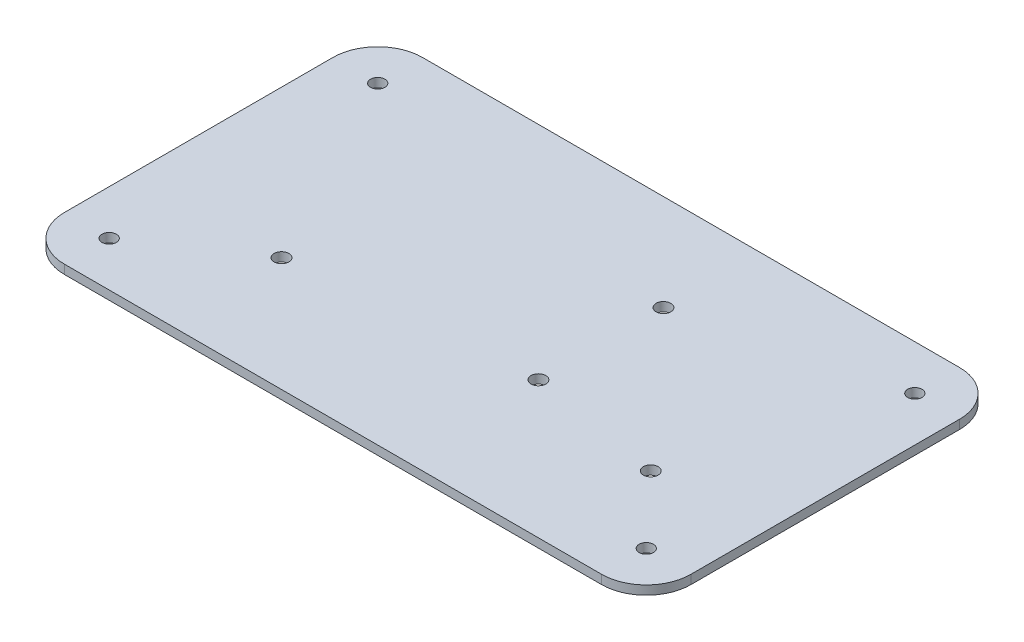
ISO-10303-21;
HEADER;
FILE_DESCRIPTION(('STEP AP214'),'2;1');
FILE_NAME('part.step','',(''),(''),'','','');
FILE_SCHEMA(('AUTOMOTIVE_DESIGN { 1 0 10303 214 1 1 1 1 }'));
ENDSEC;
DATA;
#1=APPLICATION_CONTEXT('core data for automotive mechanical design processes');
#2=APPLICATION_PROTOCOL_DEFINITION('international standard','automotive_design',2000,#1);
#3=PRODUCT_CONTEXT('',#1,'mechanical');
#4=PRODUCT('Part','Part','',(#3));
#5=PRODUCT_RELATED_PRODUCT_CATEGORY('part','',(#4));
#6=PRODUCT_DEFINITION_FORMATION('','',#4);
#7=PRODUCT_DEFINITION_CONTEXT('part definition',#1,'design');
#8=PRODUCT_DEFINITION('design','',#6,#7);
#9=PRODUCT_DEFINITION_SHAPE('','',#8);
#10=(LENGTH_UNIT() NAMED_UNIT(*) SI_UNIT(.MILLI.,.METRE.));
#11=(NAMED_UNIT(*) PLANE_ANGLE_UNIT() SI_UNIT($,.RADIAN.));
#12=(NAMED_UNIT(*) SI_UNIT($,.STERADIAN.) SOLID_ANGLE_UNIT());
#13=UNCERTAINTY_MEASURE_WITH_UNIT(LENGTH_MEASURE(1.E-05),#10,'distance_accuracy_value','');
#14=(GEOMETRIC_REPRESENTATION_CONTEXT(3) GLOBAL_UNCERTAINTY_ASSIGNED_CONTEXT((#13)) GLOBAL_UNIT_ASSIGNED_CONTEXT((#10,
#11,#12)) REPRESENTATION_CONTEXT('',''));
#15=CARTESIAN_POINT('',(0.,0.,0.));
#16=DIRECTION('',(0.,0.,1.));
#17=DIRECTION('',(1.,0.,0.));
#18=AXIS2_PLACEMENT_3D('',#15,#16,#17);
#19=CARTESIAN_POINT('',(0.,0.,0.));
#20=DIRECTION('',(0.,-1.,0.));
#21=DIRECTION('',(0.,0.,-1.));
#22=AXIS2_PLACEMENT_3D('',#19,#20,#21);
#23=PLANE('',#22);
#24=DIRECTION('',(0.,0.,1.));
#25=VECTOR('',#24,1.);
#26=CARTESIAN_POINT('',(-70.,0.,-30.));
#27=LINE('',#26,#25);
#28=CARTESIAN_POINT('',(-70.,0.,-20.));
#29=VERTEX_POINT('',#28);
#30=CARTESIAN_POINT('',(-70.,0.,40.));
#31=VERTEX_POINT('',#30);
#32=EDGE_CURVE('E116',#29,#31,#27,.T.);
#33=ORIENTED_EDGE('',*,*,#32,.F.);
#34=CARTESIAN_POINT('',(-60.,0.,-20.));
#35=DIRECTION('',(0.,1.,0.));
#36=DIRECTION('',(0.,0.,1.));
#37=AXIS2_PLACEMENT_3D('',#34,#35,#36);
#38=CIRCLE('',#37,10.);
#39=CARTESIAN_POINT('',(-60.,0.,-30.));
#40=VERTEX_POINT('',#39);
#41=EDGE_CURVE('E96',#40,#29,#38,.T.);
#42=ORIENTED_EDGE('',*,*,#41,.F.);
#43=DIRECTION('',(-1.,0.,0.));
#44=VECTOR('',#43,1.);
#45=CARTESIAN_POINT('',(-70.,0.,-30.));
#46=LINE('',#45,#44);
#47=CARTESIAN_POINT('',(60.,0.,-30.));
#48=VERTEX_POINT('',#47);
#49=EDGE_CURVE('E93',#48,#40,#46,.T.);
#50=ORIENTED_EDGE('',*,*,#49,.F.);
#51=CARTESIAN_POINT('',(60.,0.,-20.));
#52=DIRECTION('',(0.,1.,0.));
#53=DIRECTION('',(0.,0.,1.));
#54=AXIS2_PLACEMENT_3D('',#51,#52,#53);
#55=CIRCLE('',#54,10.);
#56=CARTESIAN_POINT('',(70.,0.,-20.));
#57=VERTEX_POINT('',#56);
#58=EDGE_CURVE('E80',#57,#48,#55,.T.);
#59=ORIENTED_EDGE('',*,*,#58,.F.);
#60=DIRECTION('',(0.,0.,-1.));
#61=VECTOR('',#60,1.);
#62=CARTESIAN_POINT('',(70.,0.,-30.));
#63=LINE('',#62,#61);
#64=CARTESIAN_POINT('',(70.,0.,40.));
#65=VERTEX_POINT('',#64);
#66=EDGE_CURVE('E90',#65,#57,#63,.T.);
#67=ORIENTED_EDGE('',*,*,#66,.F.);
#68=CARTESIAN_POINT('',(60.,0.,40.));
#69=DIRECTION('',(0.,1.,0.));
#70=DIRECTION('',(0.,0.,1.));
#71=AXIS2_PLACEMENT_3D('',#68,#69,#70);
#72=CIRCLE('',#71,10.);
#73=CARTESIAN_POINT('',(60.,0.,50.));
#74=VERTEX_POINT('',#73);
#75=EDGE_CURVE('E112',#74,#65,#72,.T.);
#76=ORIENTED_EDGE('',*,*,#75,.F.);
#77=DIRECTION('',(1.,0.,0.));
#78=VECTOR('',#77,1.);
#79=CARTESIAN_POINT('',(-70.,0.,50.));
#80=LINE('',#79,#78);
#81=CARTESIAN_POINT('',(-60.,0.,50.));
#82=VERTEX_POINT('',#81);
#83=EDGE_CURVE('E110',#82,#74,#80,.T.);
#84=ORIENTED_EDGE('',*,*,#83,.F.);
#85=CARTESIAN_POINT('',(-60.,0.,40.));
#86=DIRECTION('',(0.,1.,0.));
#87=DIRECTION('',(0.,0.,1.));
#88=AXIS2_PLACEMENT_3D('',#85,#86,#87);
#89=CIRCLE('',#88,10.);
#90=EDGE_CURVE('E163',#31,#82,#89,.T.);
#91=ORIENTED_EDGE('',*,*,#90,.F.);
#92=EDGE_LOOP('',(#33,#42,#50,#59,#67,#76,#84,#91));
#93=FACE_BOUND('',#92,.T.);
#94=CARTESIAN_POINT('',(-37.,0.,24.5));
#95=DIRECTION('',(0.,1.,0.));
#96=DIRECTION('',(0.,0.,1.));
#97=AXIS2_PLACEMENT_3D('',#94,#95,#96);
#98=CIRCLE('',#97,1.651);
#99=CARTESIAN_POINT('',(-37.,0.,26.151));
#100=VERTEX_POINT('',#99);
#101=EDGE_CURVE('E154',#100,#100,#98,.T.);
#102=ORIENTED_EDGE('',*,*,#101,.T.);
#103=EDGE_LOOP('',(#102));
#104=FACE_BOUND('',#103,.T.);
#105=CARTESIAN_POINT('',(45.5,0.,24.5));
#106=DIRECTION('',(0.,1.,0.));
#107=DIRECTION('',(0.,0.,1.));
#108=AXIS2_PLACEMENT_3D('',#105,#106,#107);
#109=CIRCLE('',#108,1.651);
#110=CARTESIAN_POINT('',(45.5,0.,26.151));
#111=VERTEX_POINT('',#110);
#112=EDGE_CURVE('E169',#111,#111,#109,.T.);
#113=ORIENTED_EDGE('',*,*,#112,.T.);
#114=EDGE_LOOP('',(#113));
#115=FACE_BOUND('',#114,.T.);
#116=CARTESIAN_POINT('',(15.324,0.,19.42));
#117=DIRECTION('',(0.,1.,0.));
#118=DIRECTION('',(0.,0.,1.));
#119=AXIS2_PLACEMENT_3D('',#116,#117,#118);
#120=CIRCLE('',#119,1.65);
#121=CARTESIAN_POINT('',(15.324,0.,21.07));
#122=VERTEX_POINT('',#121);
#123=EDGE_CURVE('E157',#122,#122,#120,.T.);
#124=ORIENTED_EDGE('',*,*,#123,.T.);
#125=EDGE_LOOP('',(#124));
#126=FACE_BOUND('',#125,.T.);
#127=CARTESIAN_POINT('',(15.324,0.,-8.52));
#128=DIRECTION('',(0.,1.,0.));
#129=DIRECTION('',(0.,0.,1.));
#130=AXIS2_PLACEMENT_3D('',#127,#128,#129);
#131=CIRCLE('',#130,1.651);
#132=CARTESIAN_POINT('',(15.324,0.,-6.869));
#133=VERTEX_POINT('',#132);
#134=EDGE_CURVE('E115',#133,#133,#131,.T.);
#135=ORIENTED_EDGE('',*,*,#134,.T.);
#136=EDGE_LOOP('',(#135));
#137=FACE_BOUND('',#136,.T.);
#138=CARTESIAN_POINT('',(-60.,0.,-20.));
#139=DIRECTION('',(0.,1.,0.));
#140=DIRECTION('',(0.,0.,1.));
#141=AXIS2_PLACEMENT_3D('',#138,#139,#140);
#142=CIRCLE('',#141,1.6);
#143=CARTESIAN_POINT('',(-60.,0.,-18.4));
#144=VERTEX_POINT('',#143);
#145=EDGE_CURVE('E172',#144,#144,#142,.T.);
#146=ORIENTED_EDGE('',*,*,#145,.T.);
#147=EDGE_LOOP('',(#146));
#148=FACE_BOUND('',#147,.T.);
#149=CARTESIAN_POINT('',(-60.,0.,40.));
#150=DIRECTION('',(0.,1.,0.));
#151=DIRECTION('',(0.,0.,1.));
#152=AXIS2_PLACEMENT_3D('',#149,#150,#151);
#153=CIRCLE('',#152,1.6);
#154=CARTESIAN_POINT('',(-60.,0.,41.6));
#155=VERTEX_POINT('',#154);
#156=EDGE_CURVE('E175',#155,#155,#153,.T.);
#157=ORIENTED_EDGE('',*,*,#156,.T.);
#158=EDGE_LOOP('',(#157));
#159=FACE_BOUND('',#158,.T.);
#160=CARTESIAN_POINT('',(60.,0.,-20.));
#161=DIRECTION('',(0.,1.,0.));
#162=DIRECTION('',(0.,0.,1.));
#163=AXIS2_PLACEMENT_3D('',#160,#161,#162);
#164=CIRCLE('',#163,1.6);
#165=CARTESIAN_POINT('',(60.,0.,-18.4));
#166=VERTEX_POINT('',#165);
#167=EDGE_CURVE('E177',#166,#166,#164,.T.);
#168=ORIENTED_EDGE('',*,*,#167,.T.);
#169=EDGE_LOOP('',(#168));
#170=FACE_BOUND('',#169,.T.);
#171=CARTESIAN_POINT('',(60.,0.,40.));
#172=DIRECTION('',(0.,1.,0.));
#173=DIRECTION('',(0.,0.,1.));
#174=AXIS2_PLACEMENT_3D('',#171,#172,#173);
#175=CIRCLE('',#174,1.6);
#176=CARTESIAN_POINT('',(60.,0.,41.6));
#177=VERTEX_POINT('',#176);
#178=EDGE_CURVE('E20',#177,#177,#175,.T.);
#179=ORIENTED_EDGE('',*,*,#178,.T.);
#180=EDGE_LOOP('',(#179));
#181=FACE_BOUND('',#180,.T.);
#182=ADVANCED_FACE('F17',(#93,#104,#115,#126,#137,#148,#159,#170,#181),#23,.T.);
#183=CARTESIAN_POINT('',(60.,0.,40.));
#184=DIRECTION('',(0.,1.,0.));
#185=DIRECTION('',(0.,0.,1.));
#186=AXIS2_PLACEMENT_3D('',#183,#184,#185);
#187=CYLINDRICAL_SURFACE('',#186,1.6);
#188=CARTESIAN_POINT('',(60.,2.,40.));
#189=DIRECTION('',(0.,1.,0.));
#190=DIRECTION('',(0.,0.,1.));
#191=AXIS2_PLACEMENT_3D('',#188,#189,#190);
#192=CIRCLE('',#191,1.6);
#193=CARTESIAN_POINT('',(60.,2.,41.6));
#194=VERTEX_POINT('',#193);
#195=EDGE_CURVE('E151',#194,#194,#192,.F.);
#196=ORIENTED_EDGE('',*,*,#195,.F.);
#197=EDGE_LOOP('',(#196));
#198=FACE_BOUND('',#197,.T.);
#199=ORIENTED_EDGE('',*,*,#178,.F.);
#200=EDGE_LOOP('',(#199));
#201=FACE_BOUND('',#200,.T.);
#202=ADVANCED_FACE('F185',(#198,#201),#187,.F.);
#203=CARTESIAN_POINT('',(60.,0.,-20.));
#204=DIRECTION('',(0.,1.,0.));
#205=DIRECTION('',(0.,0.,1.));
#206=AXIS2_PLACEMENT_3D('',#203,#204,#205);
#207=CYLINDRICAL_SURFACE('',#206,1.6);
#208=CARTESIAN_POINT('',(60.,2.,-20.));
#209=DIRECTION('',(0.,1.,0.));
#210=DIRECTION('',(0.,0.,1.));
#211=AXIS2_PLACEMENT_3D('',#208,#209,#210);
#212=CIRCLE('',#211,1.6);
#213=CARTESIAN_POINT('',(60.,2.,-18.4));
#214=VERTEX_POINT('',#213);
#215=EDGE_CURVE('E148',#214,#214,#212,.F.);
#216=ORIENTED_EDGE('',*,*,#215,.F.);
#217=EDGE_LOOP('',(#216));
#218=FACE_BOUND('',#217,.T.);
#219=ORIENTED_EDGE('',*,*,#167,.F.);
#220=EDGE_LOOP('',(#219));
#221=FACE_BOUND('',#220,.T.);
#222=ADVANCED_FACE('F187',(#218,#221),#207,.F.);
#223=CARTESIAN_POINT('',(-60.,0.,40.));
#224=DIRECTION('',(0.,1.,0.));
#225=DIRECTION('',(0.,0.,1.));
#226=AXIS2_PLACEMENT_3D('',#223,#224,#225);
#227=CYLINDRICAL_SURFACE('',#226,1.6);
#228=CARTESIAN_POINT('',(-60.,2.,40.));
#229=DIRECTION('',(0.,1.,0.));
#230=DIRECTION('',(0.,0.,1.));
#231=AXIS2_PLACEMENT_3D('',#228,#229,#230);
#232=CIRCLE('',#231,1.6);
#233=CARTESIAN_POINT('',(-60.,2.,41.6));
#234=VERTEX_POINT('',#233);
#235=EDGE_CURVE('E145',#234,#234,#232,.F.);
#236=ORIENTED_EDGE('',*,*,#235,.F.);
#237=EDGE_LOOP('',(#236));
#238=FACE_BOUND('',#237,.T.);
#239=ORIENTED_EDGE('',*,*,#156,.F.);
#240=EDGE_LOOP('',(#239));
#241=FACE_BOUND('',#240,.T.);
#242=ADVANCED_FACE('F194',(#238,#241),#227,.F.);
#243=CARTESIAN_POINT('',(-60.,0.,-20.));
#244=DIRECTION('',(0.,1.,0.));
#245=DIRECTION('',(0.,0.,1.));
#246=AXIS2_PLACEMENT_3D('',#243,#244,#245);
#247=CYLINDRICAL_SURFACE('',#246,1.6);
#248=CARTESIAN_POINT('',(-60.,2.,-20.));
#249=DIRECTION('',(0.,1.,0.));
#250=DIRECTION('',(0.,0.,1.));
#251=AXIS2_PLACEMENT_3D('',#248,#249,#250);
#252=CIRCLE('',#251,1.6);
#253=CARTESIAN_POINT('',(-60.,2.,-18.4));
#254=VERTEX_POINT('',#253);
#255=EDGE_CURVE('E142',#254,#254,#252,.F.);
#256=ORIENTED_EDGE('',*,*,#255,.F.);
#257=EDGE_LOOP('',(#256));
#258=FACE_BOUND('',#257,.T.);
#259=ORIENTED_EDGE('',*,*,#145,.F.);
#260=EDGE_LOOP('',(#259));
#261=FACE_BOUND('',#260,.T.);
#262=ADVANCED_FACE('F248',(#258,#261),#247,.F.);
#263=CARTESIAN_POINT('',(45.5,0.,24.5));
#264=DIRECTION('',(0.,1.,0.));
#265=DIRECTION('',(0.,0.,1.));
#266=AXIS2_PLACEMENT_3D('',#263,#264,#265);
#267=CYLINDRICAL_SURFACE('',#266,1.651);
#268=ORIENTED_EDGE('',*,*,#112,.F.);
#269=EDGE_LOOP('',(#268));
#270=FACE_BOUND('',#269,.T.);
#271=CARTESIAN_POINT('',(45.5,2.,24.5));
#272=DIRECTION('',(0.,1.,0.));
#273=DIRECTION('',(0.,0.,1.));
#274=AXIS2_PLACEMENT_3D('',#271,#272,#273);
#275=CIRCLE('',#274,1.651);
#276=CARTESIAN_POINT('',(45.5,2.,26.151));
#277=VERTEX_POINT('',#276);
#278=EDGE_CURVE('E139',#277,#277,#275,.F.);
#279=ORIENTED_EDGE('',*,*,#278,.F.);
#280=EDGE_LOOP('',(#279));
#281=FACE_BOUND('',#280,.T.);
#282=ADVANCED_FACE('F244',(#270,#281),#267,.F.);
#283=CARTESIAN_POINT('',(15.324,0.,-8.52));
#284=DIRECTION('',(0.,1.,0.));
#285=DIRECTION('',(0.,0.,1.));
#286=AXIS2_PLACEMENT_3D('',#283,#284,#285);
#287=CYLINDRICAL_SURFACE('',#286,1.651);
#288=ORIENTED_EDGE('',*,*,#134,.F.);
#289=EDGE_LOOP('',(#288));
#290=FACE_BOUND('',#289,.T.);
#291=CARTESIAN_POINT('',(15.324,2.,-8.52));
#292=DIRECTION('',(0.,1.,0.));
#293=DIRECTION('',(0.,0.,1.));
#294=AXIS2_PLACEMENT_3D('',#291,#292,#293);
#295=CIRCLE('',#294,1.651);
#296=CARTESIAN_POINT('',(15.324,2.,-6.869));
#297=VERTEX_POINT('',#296);
#298=EDGE_CURVE('E136',#297,#297,#295,.F.);
#299=ORIENTED_EDGE('',*,*,#298,.F.);
#300=EDGE_LOOP('',(#299));
#301=FACE_BOUND('',#300,.T.);
#302=ADVANCED_FACE('F240',(#290,#301),#287,.F.);
#303=CARTESIAN_POINT('',(70.,0.,-30.));
#304=DIRECTION('',(1.,0.,0.));
#305=DIRECTION('',(0.,0.,-1.));
#306=AXIS2_PLACEMENT_3D('',#303,#304,#305);
#307=PLANE('',#306);
#308=DIRECTION('',(0.,0.,1.));
#309=VECTOR('',#308,1.);
#310=CARTESIAN_POINT('',(70.,2.,0.));
#311=LINE('',#310,#309);
#312=CARTESIAN_POINT('',(70.,2.,40.));
#313=VERTEX_POINT('',#312);
#314=CARTESIAN_POINT('',(70.,2.,-20.));
#315=VERTEX_POINT('',#314);
#316=EDGE_CURVE('E135',#313,#315,#311,.F.);
#317=ORIENTED_EDGE('',*,*,#316,.F.);
#318=DIRECTION('',(0.,1.,0.));
#319=VECTOR('',#318,1.);
#320=CARTESIAN_POINT('',(70.,0.,40.));
#321=LINE('',#320,#319);
#322=EDGE_CURVE('E162',#65,#313,#321,.T.);
#323=ORIENTED_EDGE('',*,*,#322,.F.);
#324=ORIENTED_EDGE('',*,*,#66,.T.);
#325=DIRECTION('',(0.,1.,0.));
#326=VECTOR('',#325,1.);
#327=CARTESIAN_POINT('',(70.,0.,-20.));
#328=LINE('',#327,#326);
#329=EDGE_CURVE('E89',#315,#57,#328,.F.);
#330=ORIENTED_EDGE('',*,*,#329,.F.);
#331=EDGE_LOOP('',(#317,#323,#324,#330));
#332=FACE_BOUND('',#331,.T.);
#333=ADVANCED_FACE('F237',(#332),#307,.T.);
#334=CARTESIAN_POINT('',(60.,0.,-20.));
#335=DIRECTION('',(0.,1.,0.));
#336=DIRECTION('',(0.,0.,1.));
#337=AXIS2_PLACEMENT_3D('',#334,#335,#336);
#338=CYLINDRICAL_SURFACE('',#337,10.);
#339=CARTESIAN_POINT('',(60.,2.,-20.));
#340=DIRECTION('',(0.,1.,0.));
#341=DIRECTION('',(0.,0.,1.));
#342=AXIS2_PLACEMENT_3D('',#339,#340,#341);
#343=CIRCLE('',#342,10.);
#344=CARTESIAN_POINT('',(60.,2.,-30.));
#345=VERTEX_POINT('',#344);
#346=EDGE_CURVE('E133',#315,#345,#343,.T.);
#347=ORIENTED_EDGE('',*,*,#346,.F.);
#348=ORIENTED_EDGE('',*,*,#329,.T.);
#349=ORIENTED_EDGE('',*,*,#58,.T.);
#350=DIRECTION('',(0.,1.,0.));
#351=VECTOR('',#350,1.);
#352=CARTESIAN_POINT('',(60.,0.,-30.));
#353=LINE('',#352,#351);
#354=EDGE_CURVE('E87',#345,#48,#353,.F.);
#355=ORIENTED_EDGE('',*,*,#354,.F.);
#356=EDGE_LOOP('',(#347,#348,#349,#355));
#357=FACE_BOUND('',#356,.T.);
#358=ADVANCED_FACE('F85',(#357),#338,.T.);
#359=CARTESIAN_POINT('',(-70.,0.,-30.));
#360=DIRECTION('',(0.,0.,-1.));
#361=DIRECTION('',(-1.,0.,0.));
#362=AXIS2_PLACEMENT_3D('',#359,#360,#361);
#363=PLANE('',#362);
#364=ORIENTED_EDGE('',*,*,#49,.T.);
#365=DIRECTION('',(0.,1.,0.));
#366=VECTOR('',#365,1.);
#367=CARTESIAN_POINT('',(-60.,0.,-30.));
#368=LINE('',#367,#366);
#369=CARTESIAN_POINT('',(-60.,2.,-30.));
#370=VERTEX_POINT('',#369);
#371=EDGE_CURVE('E107',#370,#40,#368,.F.);
#372=ORIENTED_EDGE('',*,*,#371,.F.);
#373=DIRECTION('',(1.,0.,0.));
#374=VECTOR('',#373,1.);
#375=CARTESIAN_POINT('',(0.,2.,-30.));
#376=LINE('',#375,#374);
#377=EDGE_CURVE('E102',#345,#370,#376,.F.);
#378=ORIENTED_EDGE('',*,*,#377,.F.);
#379=ORIENTED_EDGE('',*,*,#354,.T.);
#380=EDGE_LOOP('',(#364,#372,#378,#379));
#381=FACE_BOUND('',#380,.T.);
#382=ADVANCED_FACE('F100',(#381),#363,.T.);
#383=CARTESIAN_POINT('',(-60.,0.,-20.));
#384=DIRECTION('',(0.,1.,0.));
#385=DIRECTION('',(0.,0.,1.));
#386=AXIS2_PLACEMENT_3D('',#383,#384,#385);
#387=CYLINDRICAL_SURFACE('',#386,10.);
#388=CARTESIAN_POINT('',(-60.,2.,-20.));
#389=DIRECTION('',(0.,1.,0.));
#390=DIRECTION('',(0.,0.,1.));
#391=AXIS2_PLACEMENT_3D('',#388,#389,#390);
#392=CIRCLE('',#391,10.);
#393=CARTESIAN_POINT('',(-70.,2.,-20.));
#394=VERTEX_POINT('',#393);
#395=EDGE_CURVE('E130',#370,#394,#392,.T.);
#396=ORIENTED_EDGE('',*,*,#395,.F.);
#397=ORIENTED_EDGE('',*,*,#371,.T.);
#398=ORIENTED_EDGE('',*,*,#41,.T.);
#399=DIRECTION('',(0.,1.,0.));
#400=VECTOR('',#399,1.);
#401=CARTESIAN_POINT('',(-70.,0.,-20.));
#402=LINE('',#401,#400);
#403=EDGE_CURVE('E118',#394,#29,#402,.F.);
#404=ORIENTED_EDGE('',*,*,#403,.F.);
#405=EDGE_LOOP('',(#396,#397,#398,#404));
#406=FACE_BOUND('',#405,.T.);
#407=ADVANCED_FACE('F228',(#406),#387,.T.);
#408=CARTESIAN_POINT('',(-70.,0.,-30.));
#409=DIRECTION('',(-1.,0.,0.));
#410=DIRECTION('',(0.,0.,1.));
#411=AXIS2_PLACEMENT_3D('',#408,#409,#410);
#412=PLANE('',#411);
#413=DIRECTION('',(0.,0.,1.));
#414=VECTOR('',#413,1.);
#415=CARTESIAN_POINT('',(-70.,2.,0.));
#416=LINE('',#415,#414);
#417=CARTESIAN_POINT('',(-70.,2.,40.));
#418=VERTEX_POINT('',#417);
#419=EDGE_CURVE('E129',#394,#418,#416,.T.);
#420=ORIENTED_EDGE('',*,*,#419,.F.);
#421=ORIENTED_EDGE('',*,*,#403,.T.);
#422=ORIENTED_EDGE('',*,*,#32,.T.);
#423=DIRECTION('',(0.,1.,0.));
#424=VECTOR('',#423,1.);
#425=CARTESIAN_POINT('',(-70.,0.,40.));
#426=LINE('',#425,#424);
#427=EDGE_CURVE('E165',#418,#31,#426,.F.);
#428=ORIENTED_EDGE('',*,*,#427,.F.);
#429=EDGE_LOOP('',(#420,#421,#422,#428));
#430=FACE_BOUND('',#429,.T.);
#431=ADVANCED_FACE('F224',(#430),#412,.T.);
#432=CARTESIAN_POINT('',(-60.,0.,40.));
#433=DIRECTION('',(0.,1.,0.));
#434=DIRECTION('',(0.,0.,1.));
#435=AXIS2_PLACEMENT_3D('',#432,#433,#434);
#436=CYLINDRICAL_SURFACE('',#435,10.);
#437=CARTESIAN_POINT('',(-60.,2.,40.));
#438=DIRECTION('',(0.,1.,0.));
#439=DIRECTION('',(0.,0.,1.));
#440=AXIS2_PLACEMENT_3D('',#437,#438,#439);
#441=CIRCLE('',#440,10.);
#442=CARTESIAN_POINT('',(-60.,2.,50.));
#443=VERTEX_POINT('',#442);
#444=EDGE_CURVE('E126',#418,#443,#441,.T.);
#445=ORIENTED_EDGE('',*,*,#444,.F.);
#446=ORIENTED_EDGE('',*,*,#427,.T.);
#447=ORIENTED_EDGE('',*,*,#90,.T.);
#448=DIRECTION('',(0.,1.,0.));
#449=VECTOR('',#448,1.);
#450=CARTESIAN_POINT('',(-60.,0.,50.));
#451=LINE('',#450,#449);
#452=EDGE_CURVE('E113',#443,#82,#451,.F.);
#453=ORIENTED_EDGE('',*,*,#452,.F.);
#454=EDGE_LOOP('',(#445,#446,#447,#453));
#455=FACE_BOUND('',#454,.T.);
#456=ADVANCED_FACE('F221',(#455),#436,.T.);
#457=CARTESIAN_POINT('',(-70.,0.,50.));
#458=DIRECTION('',(0.,0.,1.));
#459=DIRECTION('',(1.,0.,0.));
#460=AXIS2_PLACEMENT_3D('',#457,#458,#459);
#461=PLANE('',#460);
#462=ORIENTED_EDGE('',*,*,#83,.T.);
#463=DIRECTION('',(0.,1.,0.));
#464=VECTOR('',#463,1.);
#465=CARTESIAN_POINT('',(60.,0.,50.));
#466=LINE('',#465,#464);
#467=CARTESIAN_POINT('',(60.,2.,50.));
#468=VERTEX_POINT('',#467);
#469=EDGE_CURVE('E35',#468,#74,#466,.F.);
#470=ORIENTED_EDGE('',*,*,#469,.F.);
#471=DIRECTION('',(1.,0.,0.));
#472=VECTOR('',#471,1.);
#473=CARTESIAN_POINT('',(0.,2.,50.));
#474=LINE('',#473,#472);
#475=EDGE_CURVE('E125',#443,#468,#474,.T.);
#476=ORIENTED_EDGE('',*,*,#475,.F.);
#477=ORIENTED_EDGE('',*,*,#452,.T.);
#478=EDGE_LOOP('',(#462,#470,#476,#477));
#479=FACE_BOUND('',#478,.T.);
#480=ADVANCED_FACE('F217',(#479),#461,.T.);
#481=CARTESIAN_POINT('',(60.,0.,40.));
#482=DIRECTION('',(0.,1.,0.));
#483=DIRECTION('',(0.,0.,1.));
#484=AXIS2_PLACEMENT_3D('',#481,#482,#483);
#485=CYLINDRICAL_SURFACE('',#484,10.);
#486=CARTESIAN_POINT('',(60.,2.,40.));
#487=DIRECTION('',(0.,1.,0.));
#488=DIRECTION('',(0.,0.,1.));
#489=AXIS2_PLACEMENT_3D('',#486,#487,#488);
#490=CIRCLE('',#489,10.);
#491=EDGE_CURVE('E122',#468,#313,#490,.T.);
#492=ORIENTED_EDGE('',*,*,#491,.F.);
#493=ORIENTED_EDGE('',*,*,#469,.T.);
#494=ORIENTED_EDGE('',*,*,#75,.T.);
#495=ORIENTED_EDGE('',*,*,#322,.T.);
#496=EDGE_LOOP('',(#492,#493,#494,#495));
#497=FACE_BOUND('',#496,.T.);
#498=ADVANCED_FACE('F213',(#497),#485,.T.);
#499=CARTESIAN_POINT('',(15.324,0.,19.42));
#500=DIRECTION('',(0.,1.,0.));
#501=DIRECTION('',(0.,0.,1.));
#502=AXIS2_PLACEMENT_3D('',#499,#500,#501);
#503=CYLINDRICAL_SURFACE('',#502,1.65);
#504=ORIENTED_EDGE('',*,*,#123,.F.);
#505=EDGE_LOOP('',(#504));
#506=FACE_BOUND('',#505,.T.);
#507=CARTESIAN_POINT('',(15.324,2.,19.42));
#508=DIRECTION('',(0.,1.,0.));
#509=DIRECTION('',(0.,0.,1.));
#510=AXIS2_PLACEMENT_3D('',#507,#508,#509);
#511=CIRCLE('',#510,1.65);
#512=CARTESIAN_POINT('',(15.324,2.,21.07));
#513=VERTEX_POINT('',#512);
#514=EDGE_CURVE('E26',#513,#513,#511,.F.);
#515=ORIENTED_EDGE('',*,*,#514,.F.);
#516=EDGE_LOOP('',(#515));
#517=FACE_BOUND('',#516,.T.);
#518=ADVANCED_FACE('F206',(#506,#517),#503,.F.);
#519=CARTESIAN_POINT('',(-37.,0.,24.5));
#520=DIRECTION('',(0.,1.,0.));
#521=DIRECTION('',(0.,0.,1.));
#522=AXIS2_PLACEMENT_3D('',#519,#520,#521);
#523=CYLINDRICAL_SURFACE('',#522,1.651);
#524=ORIENTED_EDGE('',*,*,#101,.F.);
#525=EDGE_LOOP('',(#524));
#526=FACE_BOUND('',#525,.T.);
#527=CARTESIAN_POINT('',(-37.,2.,24.5));
#528=DIRECTION('',(0.,1.,0.));
#529=DIRECTION('',(0.,0.,1.));
#530=AXIS2_PLACEMENT_3D('',#527,#528,#529);
#531=CIRCLE('',#530,1.651);
#532=CARTESIAN_POINT('',(-37.,2.,26.151));
#533=VERTEX_POINT('',#532);
#534=EDGE_CURVE('E11',#533,#533,#531,.F.);
#535=ORIENTED_EDGE('',*,*,#534,.F.);
#536=EDGE_LOOP('',(#535));
#537=FACE_BOUND('',#536,.T.);
#538=ADVANCED_FACE('F200',(#526,#537),#523,.F.);
#539=CARTESIAN_POINT('',(0.,2.,0.));
#540=DIRECTION('',(0.,1.,0.));
#541=DIRECTION('',(0.,0.,1.));
#542=AXIS2_PLACEMENT_3D('',#539,#540,#541);
#543=PLANE('',#542);
#544=ORIENTED_EDGE('',*,*,#534,.T.);
#545=EDGE_LOOP('',(#544));
#546=FACE_BOUND('',#545,.T.);
#547=ORIENTED_EDGE('',*,*,#514,.T.);
#548=EDGE_LOOP('',(#547));
#549=FACE_BOUND('',#548,.T.);
#550=ORIENTED_EDGE('',*,*,#475,.T.);
#551=ORIENTED_EDGE('',*,*,#491,.T.);
#552=ORIENTED_EDGE('',*,*,#316,.T.);
#553=ORIENTED_EDGE('',*,*,#346,.T.);
#554=ORIENTED_EDGE('',*,*,#377,.T.);
#555=ORIENTED_EDGE('',*,*,#395,.T.);
#556=ORIENTED_EDGE('',*,*,#419,.T.);
#557=ORIENTED_EDGE('',*,*,#444,.T.);
#558=EDGE_LOOP('',(#550,#551,#552,#553,#554,#555,#556,#557));
#559=FACE_BOUND('',#558,.T.);
#560=ORIENTED_EDGE('',*,*,#298,.T.);
#561=EDGE_LOOP('',(#560));
#562=FACE_BOUND('',#561,.T.);
#563=ORIENTED_EDGE('',*,*,#278,.T.);
#564=EDGE_LOOP('',(#563));
#565=FACE_BOUND('',#564,.T.);
#566=ORIENTED_EDGE('',*,*,#255,.T.);
#567=EDGE_LOOP('',(#566));
#568=FACE_BOUND('',#567,.T.);
#569=ORIENTED_EDGE('',*,*,#235,.T.);
#570=EDGE_LOOP('',(#569));
#571=FACE_BOUND('',#570,.T.);
#572=ORIENTED_EDGE('',*,*,#215,.T.);
#573=EDGE_LOOP('',(#572));
#574=FACE_BOUND('',#573,.T.);
#575=ORIENTED_EDGE('',*,*,#195,.T.);
#576=EDGE_LOOP('',(#575));
#577=FACE_BOUND('',#576,.T.);
#578=ADVANCED_FACE('F198',(#546,#549,#559,#562,#565,#568,#571,#574,#577),#543,.T.);
#579=CLOSED_SHELL('',(#182,#202,#222,#242,#262,#282,#302,#333,#358,#382,#407,#431,#456,#480,
#498,#518,#538,#578));
#580=MANIFOLD_SOLID_BREP('B1',#579);
#581=ADVANCED_BREP_SHAPE_REPRESENTATION('',(#18,#580),#14);
#582=SHAPE_DEFINITION_REPRESENTATION(#9,#581);
ENDSEC;
END-ISO-10303-21;
